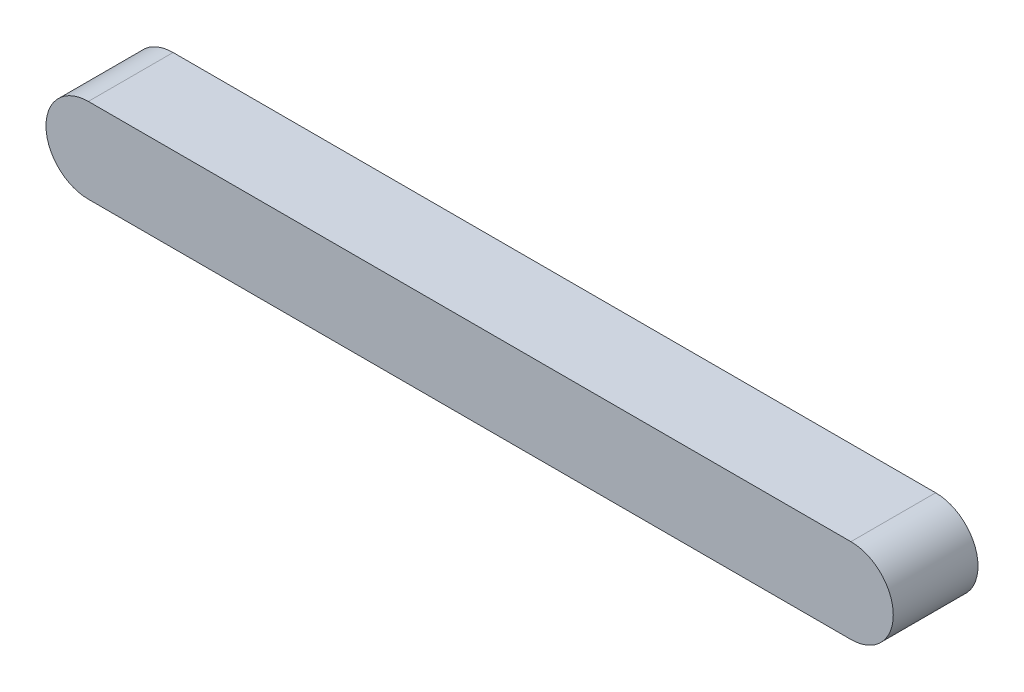
ISO-10303-21;
HEADER;
FILE_DESCRIPTION(('STEP AP214'),'2;1');
FILE_NAME('part.step','',(''),(''),'','','');
FILE_SCHEMA(('AUTOMOTIVE_DESIGN { 1 0 10303 214 1 1 1 1 }'));
ENDSEC;
DATA;
#1=APPLICATION_CONTEXT('core data for automotive mechanical design processes');
#2=APPLICATION_PROTOCOL_DEFINITION('international standard','automotive_design',2000,#1);
#3=PRODUCT_CONTEXT('',#1,'mechanical');
#4=PRODUCT('Part','Part','',(#3));
#5=PRODUCT_RELATED_PRODUCT_CATEGORY('part','',(#4));
#6=PRODUCT_DEFINITION_FORMATION('','',#4);
#7=PRODUCT_DEFINITION_CONTEXT('part definition',#1,'design');
#8=PRODUCT_DEFINITION('design','',#6,#7);
#9=PRODUCT_DEFINITION_SHAPE('','',#8);
#10=(LENGTH_UNIT() NAMED_UNIT(*) SI_UNIT(.MILLI.,.METRE.));
#11=(NAMED_UNIT(*) PLANE_ANGLE_UNIT() SI_UNIT($,.RADIAN.));
#12=(NAMED_UNIT(*) SI_UNIT($,.STERADIAN.) SOLID_ANGLE_UNIT());
#13=UNCERTAINTY_MEASURE_WITH_UNIT(LENGTH_MEASURE(1.E-05),#10,'distance_accuracy_value','');
#14=(GEOMETRIC_REPRESENTATION_CONTEXT(3) GLOBAL_UNCERTAINTY_ASSIGNED_CONTEXT((#13)) GLOBAL_UNIT_ASSIGNED_CONTEXT((#10,
#11,#12)) REPRESENTATION_CONTEXT('',''));
#15=CARTESIAN_POINT('',(0.,0.,0.));
#16=DIRECTION('',(0.,0.,1.));
#17=DIRECTION('',(1.,0.,0.));
#18=AXIS2_PLACEMENT_3D('',#15,#16,#17);
#19=CARTESIAN_POINT('',(-22.5,0.,-5.));
#20=DIRECTION('',(0.,0.,1.));
#21=DIRECTION('',(-1.,0.,0.));
#22=AXIS2_PLACEMENT_3D('',#19,#20,#21);
#23=CYLINDRICAL_SURFACE('',#22,2.5);
#24=CARTESIAN_POINT('',(-22.5,0.,0.));
#25=DIRECTION('',(0.,0.,1.));
#26=DIRECTION('',(-1.,0.,0.));
#27=AXIS2_PLACEMENT_3D('',#24,#25,#26);
#28=CIRCLE('',#27,2.5);
#29=CARTESIAN_POINT('',(-22.5,2.5,0.));
#30=VERTEX_POINT('',#29);
#31=CARTESIAN_POINT('',(-22.5,-2.5,0.));
#32=VERTEX_POINT('',#31);
#33=EDGE_CURVE('E114',#30,#32,#28,.T.);
#34=ORIENTED_EDGE('',*,*,#33,.F.);
#35=DIRECTION('',(0.,0.,1.));
#36=VECTOR('',#35,1.);
#37=CARTESIAN_POINT('',(-22.5,2.5,-5.));
#38=LINE('',#37,#36);
#39=CARTESIAN_POINT('',(-22.5,2.5,-5.));
#40=VERTEX_POINT('',#39);
#41=EDGE_CURVE('E113',#40,#30,#38,.T.);
#42=ORIENTED_EDGE('',*,*,#41,.F.);
#43=CARTESIAN_POINT('',(-22.5,0.,-5.));
#44=DIRECTION('',(0.,0.,1.));
#45=DIRECTION('',(-1.,0.,0.));
#46=AXIS2_PLACEMENT_3D('',#43,#44,#45);
#47=CIRCLE('',#46,2.5);
#48=CARTESIAN_POINT('',(-22.5,-2.5,-5.));
#49=VERTEX_POINT('',#48);
#50=EDGE_CURVE('E106',#40,#49,#47,.T.);
#51=ORIENTED_EDGE('',*,*,#50,.T.);
#52=DIRECTION('',(0.,0.,1.));
#53=VECTOR('',#52,1.);
#54=CARTESIAN_POINT('',(-22.5,-2.5,-5.));
#55=LINE('',#54,#53);
#56=EDGE_CURVE('E11',#49,#32,#55,.T.);
#57=ORIENTED_EDGE('',*,*,#56,.T.);
#58=EDGE_LOOP('',(#34,#42,#51,#57));
#59=FACE_BOUND('',#58,.T.);
#60=ADVANCED_FACE('F45',(#59),#23,.T.);
#61=CARTESIAN_POINT('',(22.5,-2.5,-5.));
#62=DIRECTION('',(0.,1.,0.));
#63=DIRECTION('',(-1.,0.,0.));
#64=AXIS2_PLACEMENT_3D('',#61,#62,#63);
#65=PLANE('',#64);
#66=DIRECTION('',(1.,0.,0.));
#67=VECTOR('',#66,1.);
#68=CARTESIAN_POINT('',(22.5,-2.5,0.));
#69=LINE('',#68,#67);
#70=CARTESIAN_POINT('',(22.5,-2.5,0.));
#71=VERTEX_POINT('',#70);
#72=EDGE_CURVE('E117',#32,#71,#69,.T.);
#73=ORIENTED_EDGE('',*,*,#72,.F.);
#74=ORIENTED_EDGE('',*,*,#56,.F.);
#75=DIRECTION('',(1.,0.,0.));
#76=VECTOR('',#75,1.);
#77=CARTESIAN_POINT('',(22.5,-2.5,-5.));
#78=LINE('',#77,#76);
#79=CARTESIAN_POINT('',(22.5,-2.5,-5.));
#80=VERTEX_POINT('',#79);
#81=EDGE_CURVE('E87',#49,#80,#78,.T.);
#82=ORIENTED_EDGE('',*,*,#81,.T.);
#83=DIRECTION('',(0.,0.,1.));
#84=VECTOR('',#83,1.);
#85=CARTESIAN_POINT('',(22.5,-2.5,-5.));
#86=LINE('',#85,#84);
#87=EDGE_CURVE('E54',#80,#71,#86,.T.);
#88=ORIENTED_EDGE('',*,*,#87,.T.);
#89=EDGE_LOOP('',(#73,#74,#82,#88));
#90=FACE_BOUND('',#89,.T.);
#91=ADVANCED_FACE('F103',(#90),#65,.F.);
#92=CARTESIAN_POINT('',(22.5,0.,-5.));
#93=DIRECTION('',(0.,0.,1.));
#94=DIRECTION('',(-1.,0.,0.));
#95=AXIS2_PLACEMENT_3D('',#92,#93,#94);
#96=CYLINDRICAL_SURFACE('',#95,2.5);
#97=CARTESIAN_POINT('',(22.5,0.,0.));
#98=DIRECTION('',(0.,0.,1.));
#99=DIRECTION('',(-1.,0.,0.));
#100=AXIS2_PLACEMENT_3D('',#97,#98,#99);
#101=CIRCLE('',#100,2.5);
#102=CARTESIAN_POINT('',(22.5,2.5,0.));
#103=VERTEX_POINT('',#102);
#104=EDGE_CURVE('E98',#71,#103,#101,.T.);
#105=ORIENTED_EDGE('',*,*,#104,.F.);
#106=ORIENTED_EDGE('',*,*,#87,.F.);
#107=CARTESIAN_POINT('',(22.5,0.,-5.));
#108=DIRECTION('',(0.,0.,1.));
#109=DIRECTION('',(-1.,0.,0.));
#110=AXIS2_PLACEMENT_3D('',#107,#108,#109);
#111=CIRCLE('',#110,2.5);
#112=CARTESIAN_POINT('',(22.5,2.5,-5.));
#113=VERTEX_POINT('',#112);
#114=EDGE_CURVE('E90',#80,#113,#111,.T.);
#115=ORIENTED_EDGE('',*,*,#114,.T.);
#116=DIRECTION('',(0.,0.,1.));
#117=VECTOR('',#116,1.);
#118=CARTESIAN_POINT('',(22.5,2.5,-5.));
#119=LINE('',#118,#117);
#120=EDGE_CURVE('E102',#113,#103,#119,.T.);
#121=ORIENTED_EDGE('',*,*,#120,.T.);
#122=EDGE_LOOP('',(#105,#106,#115,#121));
#123=FACE_BOUND('',#122,.T.);
#124=ADVANCED_FACE('F97',(#123),#96,.T.);
#125=CARTESIAN_POINT('',(-22.5,2.5,-5.));
#126=DIRECTION('',(0.,-1.,0.));
#127=DIRECTION('',(1.,0.,0.));
#128=AXIS2_PLACEMENT_3D('',#125,#126,#127);
#129=PLANE('',#128);
#130=DIRECTION('',(-1.,0.,0.));
#131=VECTOR('',#130,1.);
#132=CARTESIAN_POINT('',(-22.5,2.5,0.));
#133=LINE('',#132,#131);
#134=EDGE_CURVE('E76',#103,#30,#133,.T.);
#135=ORIENTED_EDGE('',*,*,#134,.F.);
#136=ORIENTED_EDGE('',*,*,#120,.F.);
#137=DIRECTION('',(-1.,0.,0.));
#138=VECTOR('',#137,1.);
#139=CARTESIAN_POINT('',(-22.5,2.5,-5.));
#140=LINE('',#139,#138);
#141=EDGE_CURVE('E62',#113,#40,#140,.T.);
#142=ORIENTED_EDGE('',*,*,#141,.T.);
#143=ORIENTED_EDGE('',*,*,#41,.T.);
#144=EDGE_LOOP('',(#135,#136,#142,#143));
#145=FACE_BOUND('',#144,.T.);
#146=ADVANCED_FACE('F131',(#145),#129,.F.);
#147=CARTESIAN_POINT('',(-22.5,0.,-5.));
#148=DIRECTION('',(0.,0.,1.));
#149=DIRECTION('',(-1.,0.,0.));
#150=AXIS2_PLACEMENT_3D('',#147,#148,#149);
#151=PLANE('',#150);
#152=ORIENTED_EDGE('',*,*,#50,.F.);
#153=ORIENTED_EDGE('',*,*,#141,.F.);
#154=ORIENTED_EDGE('',*,*,#114,.F.);
#155=ORIENTED_EDGE('',*,*,#81,.F.);
#156=EDGE_LOOP('',(#152,#153,#154,#155));
#157=FACE_BOUND('',#156,.T.);
#158=ADVANCED_FACE('F92',(#157),#151,.F.);
#159=CARTESIAN_POINT('',(-22.5,0.,0.));
#160=DIRECTION('',(0.,0.,1.));
#161=DIRECTION('',(-1.,0.,0.));
#162=AXIS2_PLACEMENT_3D('',#159,#160,#161);
#163=PLANE('',#162);
#164=ORIENTED_EDGE('',*,*,#33,.T.);
#165=ORIENTED_EDGE('',*,*,#72,.T.);
#166=ORIENTED_EDGE('',*,*,#104,.T.);
#167=ORIENTED_EDGE('',*,*,#134,.T.);
#168=EDGE_LOOP('',(#164,#165,#166,#167));
#169=FACE_BOUND('',#168,.T.);
#170=ADVANCED_FACE('F127',(#169),#163,.T.);
#171=CLOSED_SHELL('',(#60,#91,#124,#146,#158,#170));
#172=MANIFOLD_SOLID_BREP('B2',#171);
#173=ADVANCED_BREP_SHAPE_REPRESENTATION('',(#18,#172),#14);
#174=SHAPE_DEFINITION_REPRESENTATION(#9,#173);
ENDSEC;
END-ISO-10303-21;
